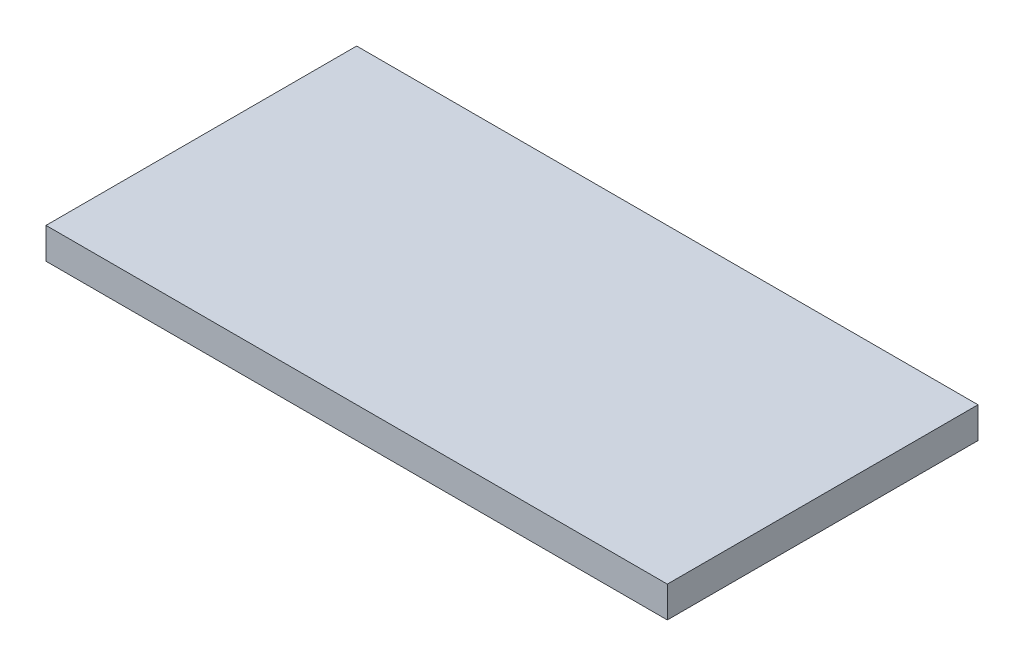
ISO-10303-21;
HEADER;
FILE_DESCRIPTION(('STEP AP214'),'2;1');
FILE_NAME('part.step','',(''),(''),'','','');
FILE_SCHEMA(('AUTOMOTIVE_DESIGN { 1 0 10303 214 1 1 1 1 }'));
ENDSEC;
DATA;
#1=APPLICATION_CONTEXT('core data for automotive mechanical design processes');
#2=APPLICATION_PROTOCOL_DEFINITION('international standard','automotive_design',2000,#1);
#3=PRODUCT_CONTEXT('',#1,'mechanical');
#4=PRODUCT('Part','Part','',(#3));
#5=PRODUCT_RELATED_PRODUCT_CATEGORY('part','',(#4));
#6=PRODUCT_DEFINITION_FORMATION('','',#4);
#7=PRODUCT_DEFINITION_CONTEXT('part definition',#1,'design');
#8=PRODUCT_DEFINITION('design','',#6,#7);
#9=PRODUCT_DEFINITION_SHAPE('','',#8);
#10=(LENGTH_UNIT() NAMED_UNIT(*) SI_UNIT(.MILLI.,.METRE.));
#11=(NAMED_UNIT(*) PLANE_ANGLE_UNIT() SI_UNIT($,.RADIAN.));
#12=(NAMED_UNIT(*) SI_UNIT($,.STERADIAN.) SOLID_ANGLE_UNIT());
#13=UNCERTAINTY_MEASURE_WITH_UNIT(LENGTH_MEASURE(1.E-05),#10,'distance_accuracy_value','');
#14=(GEOMETRIC_REPRESENTATION_CONTEXT(3) GLOBAL_UNCERTAINTY_ASSIGNED_CONTEXT((#13)) GLOBAL_UNIT_ASSIGNED_CONTEXT((#10,
#11,#12)) REPRESENTATION_CONTEXT('',''));
#15=CARTESIAN_POINT('',(0.,0.,0.));
#16=DIRECTION('',(0.,0.,1.));
#17=DIRECTION('',(1.,0.,0.));
#18=AXIS2_PLACEMENT_3D('',#15,#16,#17);
#19=CARTESIAN_POINT('',(10.,1.,-5.));
#20=DIRECTION('',(-1.,0.,0.));
#21=DIRECTION('',(0.,0.,1.));
#22=AXIS2_PLACEMENT_3D('',#19,#20,#21);
#23=PLANE('',#22);
#24=DIRECTION('',(0.,0.,-1.));
#25=VECTOR('',#24,1.);
#26=CARTESIAN_POINT('',(10.,0.,-5.));
#27=LINE('',#26,#25);
#28=CARTESIAN_POINT('',(10.,0.,5.));
#29=VERTEX_POINT('',#28);
#30=CARTESIAN_POINT('',(10.,0.,-5.));
#31=VERTEX_POINT('',#30);
#32=EDGE_CURVE('E98',#29,#31,#27,.T.);
#33=ORIENTED_EDGE('',*,*,#32,.T.);
#34=DIRECTION('',(0.,-1.,0.));
#35=VECTOR('',#34,1.);
#36=CARTESIAN_POINT('',(10.,1.,-5.));
#37=LINE('',#36,#35);
#38=CARTESIAN_POINT('',(10.,1.,-5.));
#39=VERTEX_POINT('',#38);
#40=EDGE_CURVE('E11',#39,#31,#37,.T.);
#41=ORIENTED_EDGE('',*,*,#40,.F.);
#42=DIRECTION('',(0.,0.,-1.));
#43=VECTOR('',#42,1.);
#44=CARTESIAN_POINT('',(10.,1.,-5.));
#45=LINE('',#44,#43);
#46=CARTESIAN_POINT('',(10.,1.,5.));
#47=VERTEX_POINT('',#46);
#48=EDGE_CURVE('E86',#47,#39,#45,.T.);
#49=ORIENTED_EDGE('',*,*,#48,.F.);
#50=DIRECTION('',(0.,-1.,0.));
#51=VECTOR('',#50,1.);
#52=CARTESIAN_POINT('',(10.,1.,5.));
#53=LINE('',#52,#51);
#54=EDGE_CURVE('E94',#47,#29,#53,.T.);
#55=ORIENTED_EDGE('',*,*,#54,.T.);
#56=EDGE_LOOP('',(#33,#41,#49,#55));
#57=FACE_BOUND('',#56,.T.);
#58=ADVANCED_FACE('F35',(#57),#23,.F.);
#59=CARTESIAN_POINT('',(-10.,1.,-5.));
#60=DIRECTION('',(0.,0.,1.));
#61=DIRECTION('',(1.,0.,0.));
#62=AXIS2_PLACEMENT_3D('',#59,#60,#61);
#63=PLANE('',#62);
#64=DIRECTION('',(-1.,0.,0.));
#65=VECTOR('',#64,1.);
#66=CARTESIAN_POINT('',(-10.,0.,-5.));
#67=LINE('',#66,#65);
#68=CARTESIAN_POINT('',(-10.,0.,-5.));
#69=VERTEX_POINT('',#68);
#70=EDGE_CURVE('E90',#31,#69,#67,.T.);
#71=ORIENTED_EDGE('',*,*,#70,.T.);
#72=DIRECTION('',(0.,-1.,0.));
#73=VECTOR('',#72,1.);
#74=CARTESIAN_POINT('',(-10.,1.,-5.));
#75=LINE('',#74,#73);
#76=CARTESIAN_POINT('',(-10.,1.,-5.));
#77=VERTEX_POINT('',#76);
#78=EDGE_CURVE('E43',#77,#69,#75,.T.);
#79=ORIENTED_EDGE('',*,*,#78,.F.);
#80=DIRECTION('',(-1.,0.,0.));
#81=VECTOR('',#80,1.);
#82=CARTESIAN_POINT('',(-10.,1.,-5.));
#83=LINE('',#82,#81);
#84=EDGE_CURVE('E81',#39,#77,#83,.T.);
#85=ORIENTED_EDGE('',*,*,#84,.F.);
#86=ORIENTED_EDGE('',*,*,#40,.T.);
#87=EDGE_LOOP('',(#71,#79,#85,#86));
#88=FACE_BOUND('',#87,.T.);
#89=ADVANCED_FACE('F89',(#88),#63,.F.);
#90=CARTESIAN_POINT('',(-10.,1.,-5.));
#91=DIRECTION('',(1.,0.,0.));
#92=DIRECTION('',(0.,0.,-1.));
#93=AXIS2_PLACEMENT_3D('',#90,#91,#92);
#94=PLANE('',#93);
#95=DIRECTION('',(0.,0.,1.));
#96=VECTOR('',#95,1.);
#97=CARTESIAN_POINT('',(-10.,0.,-5.));
#98=LINE('',#97,#96);
#99=CARTESIAN_POINT('',(-9.99999999999999,0.,5.));
#100=VERTEX_POINT('',#99);
#101=EDGE_CURVE('E68',#69,#100,#98,.T.);
#102=ORIENTED_EDGE('',*,*,#101,.T.);
#103=DIRECTION('',(0.,-1.,0.));
#104=VECTOR('',#103,1.);
#105=CARTESIAN_POINT('',(-9.99999999999999,1.,5.));
#106=LINE('',#105,#104);
#107=CARTESIAN_POINT('',(-9.99999999999999,1.,5.));
#108=VERTEX_POINT('',#107);
#109=EDGE_CURVE('E91',#108,#100,#106,.T.);
#110=ORIENTED_EDGE('',*,*,#109,.F.);
#111=DIRECTION('',(0.,0.,1.));
#112=VECTOR('',#111,1.);
#113=CARTESIAN_POINT('',(-10.,1.,-5.));
#114=LINE('',#113,#112);
#115=EDGE_CURVE('E84',#77,#108,#114,.T.);
#116=ORIENTED_EDGE('',*,*,#115,.F.);
#117=ORIENTED_EDGE('',*,*,#78,.T.);
#118=EDGE_LOOP('',(#102,#110,#116,#117));
#119=FACE_BOUND('',#118,.T.);
#120=ADVANCED_FACE('F92',(#119),#94,.F.);
#121=CARTESIAN_POINT('',(-9.99999999999999,1.,5.));
#122=DIRECTION('',(0.,0.,-1.));
#123=DIRECTION('',(-1.,0.,0.));
#124=AXIS2_PLACEMENT_3D('',#121,#122,#123);
#125=PLANE('',#124);
#126=DIRECTION('',(1.,0.,0.));
#127=VECTOR('',#126,1.);
#128=CARTESIAN_POINT('',(-9.99999999999999,0.,5.));
#129=LINE('',#128,#127);
#130=EDGE_CURVE('E74',#100,#29,#129,.T.);
#131=ORIENTED_EDGE('',*,*,#130,.T.);
#132=ORIENTED_EDGE('',*,*,#54,.F.);
#133=DIRECTION('',(1.,0.,0.));
#134=VECTOR('',#133,1.);
#135=CARTESIAN_POINT('',(-9.99999999999999,1.,5.));
#136=LINE('',#135,#134);
#137=EDGE_CURVE('E51',#108,#47,#136,.T.);
#138=ORIENTED_EDGE('',*,*,#137,.F.);
#139=ORIENTED_EDGE('',*,*,#109,.T.);
#140=EDGE_LOOP('',(#131,#132,#138,#139));
#141=FACE_BOUND('',#140,.T.);
#142=ADVANCED_FACE('F105',(#141),#125,.F.);
#143=CARTESIAN_POINT('',(0.,1.,0.));
#144=DIRECTION('',(0.,1.,0.));
#145=DIRECTION('',(0.,0.,1.));
#146=AXIS2_PLACEMENT_3D('',#143,#144,#145);
#147=PLANE('',#146);
#148=ORIENTED_EDGE('',*,*,#48,.T.);
#149=ORIENTED_EDGE('',*,*,#84,.T.);
#150=ORIENTED_EDGE('',*,*,#115,.T.);
#151=ORIENTED_EDGE('',*,*,#137,.T.);
#152=EDGE_LOOP('',(#148,#149,#150,#151));
#153=FACE_BOUND('',#152,.T.);
#154=ADVANCED_FACE('F82',(#153),#147,.T.);
#155=CARTESIAN_POINT('',(0.,0.,0.));
#156=DIRECTION('',(0.,1.,0.));
#157=DIRECTION('',(0.,0.,1.));
#158=AXIS2_PLACEMENT_3D('',#155,#156,#157);
#159=PLANE('',#158);
#160=ORIENTED_EDGE('',*,*,#32,.F.);
#161=ORIENTED_EDGE('',*,*,#130,.F.);
#162=ORIENTED_EDGE('',*,*,#101,.F.);
#163=ORIENTED_EDGE('',*,*,#70,.F.);
#164=EDGE_LOOP('',(#160,#161,#162,#163));
#165=FACE_BOUND('',#164,.T.);
#166=ADVANCED_FACE('F108',(#165),#159,.F.);
#167=CLOSED_SHELL('',(#58,#89,#120,#142,#154,#166));
#168=MANIFOLD_SOLID_BREP('B2',#167);
#169=ADVANCED_BREP_SHAPE_REPRESENTATION('',(#18,#168),#14);
#170=SHAPE_DEFINITION_REPRESENTATION(#9,#169);
ENDSEC;
END-ISO-10303-21;
